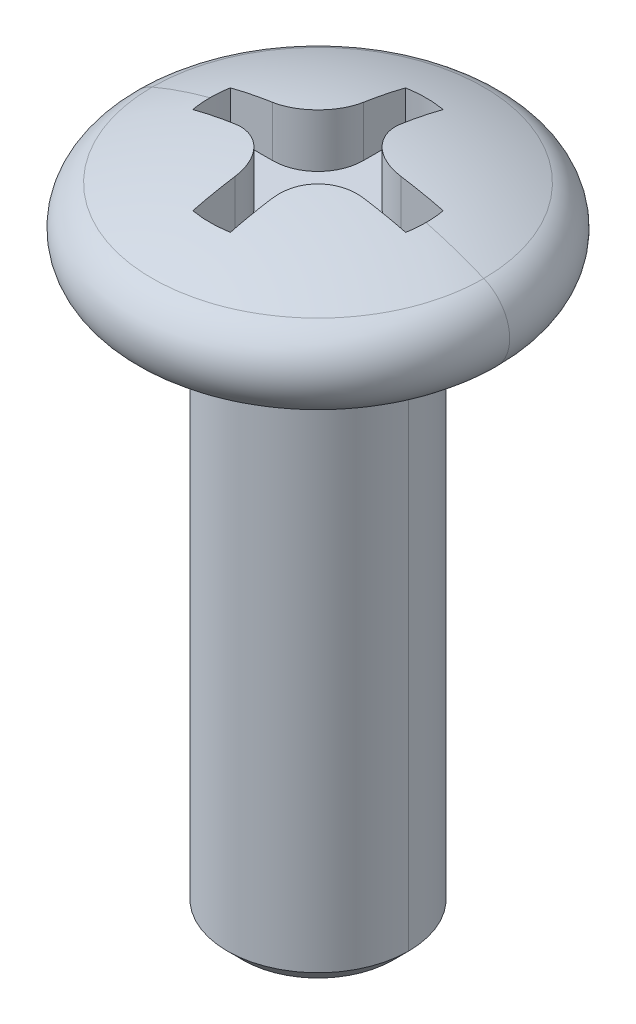
ISO-10303-21;
HEADER;
FILE_DESCRIPTION(('STEP AP214'),'2;1');
FILE_NAME('part.step','',(''),(''),'','','');
FILE_SCHEMA(('AUTOMOTIVE_DESIGN { 1 0 10303 214 1 1 1 1 }'));
ENDSEC;
DATA;
#1=APPLICATION_CONTEXT('core data for automotive mechanical design processes');
#2=APPLICATION_PROTOCOL_DEFINITION('international standard','automotive_design',2000,#1);
#3=PRODUCT_CONTEXT('',#1,'mechanical');
#4=PRODUCT('Part','Part','',(#3));
#5=PRODUCT_RELATED_PRODUCT_CATEGORY('part','',(#4));
#6=PRODUCT_DEFINITION_FORMATION('','',#4);
#7=PRODUCT_DEFINITION_CONTEXT('part definition',#1,'design');
#8=PRODUCT_DEFINITION('design','',#6,#7);
#9=PRODUCT_DEFINITION_SHAPE('','',#8);
#10=(LENGTH_UNIT() NAMED_UNIT(*) SI_UNIT(.MILLI.,.METRE.));
#11=(NAMED_UNIT(*) PLANE_ANGLE_UNIT() SI_UNIT($,.RADIAN.));
#12=(NAMED_UNIT(*) SI_UNIT($,.STERADIAN.) SOLID_ANGLE_UNIT());
#13=UNCERTAINTY_MEASURE_WITH_UNIT(LENGTH_MEASURE(1.E-05),#10,'distance_accuracy_value','');
#14=(GEOMETRIC_REPRESENTATION_CONTEXT(3) GLOBAL_UNCERTAINTY_ASSIGNED_CONTEXT((#13)) GLOBAL_UNIT_ASSIGNED_CONTEXT((#10,
#11,#12)) REPRESENTATION_CONTEXT('',''));
#15=CARTESIAN_POINT('',(0.,0.,0.));
#16=DIRECTION('',(0.,0.,1.));
#17=DIRECTION('',(1.,0.,0.));
#18=AXIS2_PLACEMENT_3D('',#15,#16,#17);
#19=CARTESIAN_POINT('',(-0.9192388155425,0.8,0.9192388155425));
#20=DIRECTION('',(0.,-1.,0.));
#21=DIRECTION('',(1.,0.,0.));
#22=AXIS2_PLACEMENT_3D('',#19,#20,#21);
#23=CYLINDRICAL_SURFACE('',#22,0.65);
#24=DIRECTION('',(0.,1.,0.));
#25=VECTOR('',#24,1.);
#26=CARTESIAN_POINT('',(-0.2692388155425,0.8,0.9192388155425));
#27=LINE('',#26,#25);
#28=CARTESIAN_POINT('',(-0.2692388155425,0.8,0.9192388155425));
#29=VERTEX_POINT('',#28);
#30=CARTESIAN_POINT('',(-0.2692388155425,1.524713772175,0.9192388155425));
#31=VERTEX_POINT('',#30);
#32=EDGE_CURVE('E11',#29,#31,#27,.T.);
#33=ORIENTED_EDGE('',*,*,#32,.F.);
#34=CARTESIAN_POINT('',(-0.9192388155425,0.8,0.9192388155425));
#35=DIRECTION('',(0.,1.,0.));
#36=DIRECTION('',(1.,0.,0.));
#37=AXIS2_PLACEMENT_3D('',#34,#35,#36);
#38=CIRCLE('',#37,0.65);
#39=CARTESIAN_POINT('',(-0.9192388155425,0.8,0.2692388155425));
#40=VERTEX_POINT('',#39);
#41=EDGE_CURVE('E385',#29,#40,#38,.T.);
#42=ORIENTED_EDGE('',*,*,#41,.T.);
#43=DIRECTION('',(0.,-1.,0.));
#44=VECTOR('',#43,1.);
#45=CARTESIAN_POINT('',(-0.9192388155425,1.524713772175,0.2692388155425));
#46=LINE('',#45,#44);
#47=CARTESIAN_POINT('',(-0.9192388155425,1.524713772175,0.2692388155425));
#48=VERTEX_POINT('',#47);
#49=EDGE_CURVE('E293',#48,#40,#46,.T.);
#50=ORIENTED_EDGE('',*,*,#49,.F.);
#51=CARTESIAN_POINT('',(-0.9192388155425,1.524713772175,0.2692388155425));
#52=CARTESIAN_POINT('',(-0.9074310686068,1.52650615110908,0.269238446253447));
#53=CARTESIAN_POINT('',(-0.895615272198012,1.52824602192528,0.269560549683236));
#54=CARTESIAN_POINT('',(-0.872090656978426,1.53160575261905,0.27084490478952));
#55=CARTESIAN_POINT('',(-0.860381692032317,1.53322640316312,0.271802416359884));
#56=CARTESIAN_POINT('',(-0.837104387656604,1.5363477025073,0.274343450276883));
#57=CARTESIAN_POINT('',(-0.825535647138162,1.53784914564995,0.27592232050701));
#58=CARTESIAN_POINT('',(-0.80257104060165,1.54073202301527,0.279689739434019));
#59=CARTESIAN_POINT('',(-0.791174529032696,1.54211425498701,0.281873742397225));
#60=CARTESIAN_POINT('',(-0.768585092818777,1.54475870767343,0.286833721121907));
#61=CARTESIAN_POINT('',(-0.757391289952753,1.54602172909309,0.289605269829644));
#62=CARTESIAN_POINT('',(-0.735236411936503,1.54842775758934,0.295721199796129));
#63=CARTESIAN_POINT('',(-0.7242742382256,1.54957156789024,0.299061285305573));
#64=CARTESIAN_POINT('',(-0.702610136797941,1.55173917183213,0.306293886986267));
#65=CARTESIAN_POINT('',(-0.691906903150353,1.55276377074186,0.310182249932129));
#66=CARTESIAN_POINT('',(-0.670786541964911,1.55469294997501,0.318489853379582));
#67=CARTESIAN_POINT('',(-0.66036791460645,1.55559833711162,0.322905093420829));
#68=CARTESIAN_POINT('',(-0.639840938980817,1.55728909144049,0.33224387256373));
#69=CARTESIAN_POINT('',(-0.629730910926184,1.55807526646086,0.337163573097342));
#70=CARTESIAN_POINT('',(-0.609843599254808,1.55952759560189,0.347487789403707));
#71=CARTESIAN_POINT('',(-0.60006447016581,1.56019455800855,0.352888636532991));
#72=CARTESIAN_POINT('',(-0.580859701553964,1.56140846202144,0.364150875794801));
#73=CARTESIAN_POINT('',(-0.571432065433913,1.56195621178094,0.370008776133694));
#74=CARTESIAN_POINT('',(-0.552949301480528,1.56293168940802,0.382160182683809));
#75=CARTESIAN_POINT('',(-0.543892040690252,1.56336022469205,0.388450379761691));
#76=CARTESIAN_POINT('',(-0.526167324419638,1.56409727950977,0.401440881835909));
#77=CARTESIAN_POINT('',(-0.517497614488045,1.56440660503152,0.408138065091579));
#78=CARTESIAN_POINT('',(-0.500563572370234,1.56490522272647,0.42191660729582));
#79=CARTESIAN_POINT('',(-0.492296879224918,1.56509531895082,0.428995035439314));
#80=CARTESIAN_POINT('',(-0.476182774632976,1.56535555125927,0.443509757008436));
#81=CARTESIAN_POINT('',(-0.468332910393138,1.56542648814329,0.450943313374388));
#82=CARTESIAN_POINT('',(-0.453064566345436,1.56544814276625,0.466141895467096));
#83=CARTESIAN_POINT('',(-0.4456435575074,1.56539965954977,0.473904378359195));
#84=CARTESIAN_POINT('',(-0.432014745253798,1.56519502134574,0.488886267612526));
#85=CARTESIAN_POINT('',(-0.425764755762494,1.56505168982395,0.49606753913544));
#86=CARTESIAN_POINT('',(-0.413545282212392,1.56467217208865,0.51074662327956));
#87=CARTESIAN_POINT('',(-0.407578026317929,1.56443535321255,0.518246275235795));
#88=CARTESIAN_POINT('',(-0.395942263672614,1.56386863409642,0.533552700650459));
#89=CARTESIAN_POINT('',(-0.390276114532105,1.5635381000105,0.541361242664686));
#90=CARTESIAN_POINT('',(-0.379260528967508,1.56278401129438,0.557275074640531));
#91=CARTESIAN_POINT('',(-0.373913576829251,1.56235982402645,0.56538205431645));
#92=CARTESIAN_POINT('',(-0.363554153178315,1.56141841144204,0.581881281223663));
#93=CARTESIAN_POINT('',(-0.358544290296129,1.56090055452427,0.590275130293663));
#94=CARTESIAN_POINT('',(-0.348876516433032,1.55977180587096,0.607335537358158));
#95=CARTESIAN_POINT('',(-0.344221335253281,1.55916028407257,0.616003600586359));
#96=CARTESIAN_POINT('',(-0.33528004615892,1.55784420282904,0.633598782636722));
#97=CARTESIAN_POINT('',(-0.330996785542429,1.55713901515387,0.642527301359418));
#98=CARTESIAN_POINT('',(-0.322816040481119,1.55563560054651,0.660628646432735));
#99=CARTESIAN_POINT('',(-0.318921516560794,1.5548367475443,0.669802758751507));
#100=CARTESIAN_POINT('',(-0.311534462825615,1.55314599994537,0.688379448573204));
#101=CARTESIAN_POINT('',(-0.308045001919916,1.5522534817337,0.697783189652646));
#102=CARTESIAN_POINT('',(-0.301483738003251,1.55037540119559,0.716802205043263));
#103=CARTESIAN_POINT('',(-0.298415106866604,1.54938921799037,0.726418512263573));
#104=CARTESIAN_POINT('',(-0.292710542629367,1.54732380465771,0.745844647122604));
#105=CARTESIAN_POINT('',(-0.290077878381705,1.54624395665065,0.755655368945319));
#106=CARTESIAN_POINT('',(-0.28525959111327,1.54399121059184,0.775451252548606));
#107=CARTESIAN_POINT('',(-0.283077327356886,1.54281769790553,0.785437161988074));
#108=CARTESIAN_POINT('',(-0.279173423101076,1.54037761937338,0.805563289154129));
#109=CARTESIAN_POINT('',(-0.277455225209891,1.53911044236993,0.815704100501387));
#110=CARTESIAN_POINT('',(-0.274492171202288,1.53648303092039,0.836118873825482));
#111=CARTESIAN_POINT('',(-0.273250833208777,1.53512218900115,0.846393268226588));
#112=CARTESIAN_POINT('',(-0.271253392774698,1.53230744679113,0.867053037888451));
#113=CARTESIAN_POINT('',(-0.27050087642024,1.53085294293673,0.877438677494751));
#114=CARTESIAN_POINT('',(-0.269491653146706,1.52785086229013,0.898297834867702));
#115=CARTESIAN_POINT('',(-0.269238589138356,1.52630268593064,0.908771442771305));
#116=CARTESIAN_POINT('',(-0.2692388155425,1.524713772175,0.919238815542503));
#117=B_SPLINE_CURVE_WITH_KNOTS('',3,(#51,#52,#53,#54,#55,#56,#57,#58,#59,#60,#61,#62,#63,#64,
#65,#66,#67,#68,#69,#70,#71,#72,#73,#74,#75,#76,#77,#78,#79,#80,#81,#82,#83,#84,#85,#86,#87,#88,
#89,#90,#91,#92,#93,#94,#95,#96,#97,#98,#99,#100,#101,#102,#103,#104,#105,#106,#107,#108,#109,
#110,#111,#112,#113,#114,#115,#116),.UNSPECIFIED.,.F.,.F.,(4,2,2,2,2,2,2,2,2,2,2,2,2,2,2,2,2,2,
2,2,2,2,2,2,2,2,2,2,2,2,2,2,4),(0.,0.0358246705922917,0.0713850512791919,0.106684107049631,
0.141724869252869,0.176510436788276,0.21104397727965,0.245328728230408,0.279367998155793,
0.31316516768797,0.346723690649654,0.380047095091673,0.413138984289623,0.44600303769455,
0.478643011832356,0.511062741146402,0.543266138777583,0.571820381132513,0.600571267333102,
0.629521450077506,0.658673527642513,0.688030044680905,0.717593493038226,0.747366312586197,
0.777350892070108,0.807549569967726,0.837964635357372,0.868598328792974,0.899452843184075,
0.930530324678863,0.961832873548483,0.993362545070976,1.02512135041333),.UNSPECIFIED.);
#118=EDGE_CURVE('E276',#48,#31,#117,.T.);
#119=ORIENTED_EDGE('',*,*,#118,.T.);
#120=EDGE_LOOP('',(#33,#42,#50,#119));
#121=FACE_BOUND('',#120,.T.);
#122=ADVANCED_FACE('F17',(#121),#23,.T.);
#123=CARTESIAN_POINT('',(-0.2692388155425,0.8,1.526437178598));
#124=DIRECTION('',(-1.,0.,0.));
#125=DIRECTION('',(0.,0.,1.));
#126=AXIS2_PLACEMENT_3D('',#123,#124,#125);
#127=PLANE('',#126);
#128=DIRECTION('',(-7.80448763563202E-08,-0.999999999992203,3.94812511535701E-06));
#129=VECTOR('',#128,1.);
#130=CARTESIAN_POINT('',(-0.2692387686505,1.400833809048,1.526438143998));
#131=LINE('',#130,#129);
#132=CARTESIAN_POINT('',(-0.2692388155425,1.400834055347,1.526437178598));
#133=VERTEX_POINT('',#132);
#134=CARTESIAN_POINT('',(-0.269237102762,0.8,1.526437480703));
#135=VERTEX_POINT('',#134);
#136=EDGE_CURVE('E27',#133,#135,#131,.T.);
#137=ORIENTED_EDGE('',*,*,#136,.T.);
#138=DIRECTION('',(0.,0.,1.));
#139=VECTOR('',#138,1.);
#140=CARTESIAN_POINT('',(-0.2692388155425,0.8,0.9192388155425));
#141=LINE('',#140,#139);
#142=EDGE_CURVE('E371',#29,#135,#141,.T.);
#143=ORIENTED_EDGE('',*,*,#142,.F.);
#144=ORIENTED_EDGE('',*,*,#32,.T.);
#145=CARTESIAN_POINT('',(-0.2692388155425,-4.530985590341,0.));
#146=DIRECTION('',(1.,0.,0.));
#147=DIRECTION('',(0.,0.988674149471102,0.1500780669105));
#148=AXIS2_PLACEMENT_3D('',#145,#146,#147);
#149=CIRCLE('',#148,6.125071001154);
#150=EDGE_CURVE('E372',#31,#133,#149,.T.);
#151=ORIENTED_EDGE('',*,*,#150,.T.);
#152=EDGE_LOOP('',(#137,#143,#144,#151));
#153=FACE_BOUND('',#152,.T.);
#154=ADVANCED_FACE('F359',(#153),#127,.F.);
#155=CARTESIAN_POINT('',(0.,0.8,0.));
#156=DIRECTION('',(0.,-1.,0.));
#157=DIRECTION('',(1.,0.,0.));
#158=AXIS2_PLACEMENT_3D('',#155,#156,#157);
#159=CYLINDRICAL_SURFACE('',#158,1.55);
#160=DIRECTION('',(0.,1.,0.));
#161=VECTOR('',#160,1.);
#162=CARTESIAN_POINT('',(0.2692388155425,0.8,1.526437178598));
#163=LINE('',#162,#161);
#164=CARTESIAN_POINT('',(0.2692388155425,0.8,1.526437178598));
#165=VERTEX_POINT('',#164);
#166=CARTESIAN_POINT('',(0.2692388155424,1.400834055347,1.526437178598));
#167=VERTEX_POINT('',#166);
#168=EDGE_CURVE('E271',#165,#167,#163,.T.);
#169=ORIENTED_EDGE('',*,*,#168,.F.);
#170=CARTESIAN_POINT('',(0.,0.8,0.));
#171=DIRECTION('',(0.,-1.,0.));
#172=DIRECTION('',(0.173702461640309,0.,0.984798179740447));
#173=AXIS2_PLACEMENT_3D('',#170,#171,#172);
#174=CIRCLE('',#173,1.55);
#175=EDGE_CURVE('E378',#165,#135,#174,.T.);
#176=ORIENTED_EDGE('',*,*,#175,.T.);
#177=ORIENTED_EDGE('',*,*,#136,.F.);
#178=CARTESIAN_POINT('',(0.,1.400834055347,0.));
#179=DIRECTION('',(0.,1.,0.));
#180=DIRECTION('',(-0.173702461640291,0.,0.98479817974045));
#181=AXIS2_PLACEMENT_3D('',#178,#179,#180);
#182=CIRCLE('',#181,1.55);
#183=EDGE_CURVE('E404',#133,#167,#182,.T.);
#184=ORIENTED_EDGE('',*,*,#183,.T.);
#185=EDGE_LOOP('',(#169,#176,#177,#184));
#186=FACE_BOUND('',#185,.T.);
#187=ADVANCED_FACE('F356',(#186),#159,.F.);
#188=CARTESIAN_POINT('',(0.2692388155425,0.8,0.9192388155425));
#189=DIRECTION('',(1.,0.,0.));
#190=DIRECTION('',(0.,1.,0.));
#191=AXIS2_PLACEMENT_3D('',#188,#189,#190);
#192=PLANE('',#191);
#193=DIRECTION('',(0.,-1.,0.));
#194=VECTOR('',#193,1.);
#195=CARTESIAN_POINT('',(0.2692388155425,1.524713772175,0.9192388155426));
#196=LINE('',#195,#194);
#197=CARTESIAN_POINT('',(0.2692388155425,1.524713772175,0.9192388155425));
#198=VERTEX_POINT('',#197);
#199=CARTESIAN_POINT('',(0.2692388155425,0.8,0.9192388155425));
#200=VERTEX_POINT('',#199);
#201=EDGE_CURVE('E268',#198,#200,#196,.T.);
#202=ORIENTED_EDGE('',*,*,#201,.T.);
#203=DIRECTION('',(0.,0.,-1.));
#204=VECTOR('',#203,1.);
#205=CARTESIAN_POINT('',(0.2692388155425,0.8,1.526437178598));
#206=LINE('',#205,#204);
#207=EDGE_CURVE('E382',#165,#200,#206,.T.);
#208=ORIENTED_EDGE('',*,*,#207,.F.);
#209=ORIENTED_EDGE('',*,*,#168,.T.);
#210=CARTESIAN_POINT('',(0.2692388155425,-4.530985590341,0.));
#211=DIRECTION('',(-1.,0.,0.));
#212=DIRECTION('',(0.,0.968449124029834,0.249211344376309));
#213=AXIS2_PLACEMENT_3D('',#210,#211,#212);
#214=CIRCLE('',#213,6.125071001154);
#215=EDGE_CURVE('E402',#167,#198,#214,.T.);
#216=ORIENTED_EDGE('',*,*,#215,.T.);
#217=EDGE_LOOP('',(#202,#208,#209,#216));
#218=FACE_BOUND('',#217,.T.);
#219=ADVANCED_FACE('F352',(#218),#192,.F.);
#220=CARTESIAN_POINT('',(0.9192388155425,0.8,0.9192388155425));
#221=DIRECTION('',(0.,-1.,0.));
#222=DIRECTION('',(1.,0.,0.));
#223=AXIS2_PLACEMENT_3D('',#220,#221,#222);
#224=CYLINDRICAL_SURFACE('',#223,0.65);
#225=DIRECTION('',(0.,1.,0.));
#226=VECTOR('',#225,1.);
#227=CARTESIAN_POINT('',(0.9192388155425,0.8,0.2692388155425));
#228=LINE('',#227,#226);
#229=CARTESIAN_POINT('',(0.9192388155425,0.8,0.2692388155425));
#230=VERTEX_POINT('',#229);
#231=CARTESIAN_POINT('',(0.9192388155425,1.524713772175,0.2692388155425));
#232=VERTEX_POINT('',#231);
#233=EDGE_CURVE('E265',#230,#232,#228,.T.);
#234=ORIENTED_EDGE('',*,*,#233,.F.);
#235=CARTESIAN_POINT('',(0.9192388155425,0.8,0.9192388155425));
#236=DIRECTION('',(0.,1.,0.));
#237=DIRECTION('',(0.,0.,-1.));
#238=AXIS2_PLACEMENT_3D('',#235,#236,#237);
#239=CIRCLE('',#238,0.65);
#240=EDGE_CURVE('E394',#230,#200,#239,.T.);
#241=ORIENTED_EDGE('',*,*,#240,.T.);
#242=ORIENTED_EDGE('',*,*,#201,.F.);
#243=CARTESIAN_POINT('',(0.2692388155425,1.524713772175,0.9192388155426));
#244=CARTESIAN_POINT('',(0.2692388155425,1.528173358562,0.8964479860821));
#245=CARTESIAN_POINT('',(0.2716391462575,1.534710181967,0.8509457547024));
#246=CARTESIAN_POINT('',(0.2823174412293,1.543276861226,0.7836954329013));
#247=CARTESIAN_POINT('',(0.2999141859791,1.550540336036,0.7180699570745));
#248=CARTESIAN_POINT('',(0.3241734858009,1.556433791834,0.654798701252));
#249=CARTESIAN_POINT('',(0.3549032683568,1.560918753447,0.5943551458814));
#250=CARTESIAN_POINT('',(0.3915438705881,1.563933367371,0.5377297774847));
#251=CARTESIAN_POINT('',(0.4337882814405,1.565477277769,0.4852465083553));
#252=CARTESIAN_POINT('',(0.4813863367753,1.565539945037,0.4372327998011));
#253=CARTESIAN_POINT('',(0.5343962340297,1.564076941955,0.3939254125477));
#254=CARTESIAN_POINT('',(0.5909074605196,1.561128800732,0.3569587413935));
#255=CARTESIAN_POINT('',(0.6480865921722,1.556959695013,0.3274019004167));
#256=CARTESIAN_POINT('',(0.7034772044515,1.551941345377,0.3052341972903));
#257=CARTESIAN_POINT('',(0.7539825373544,1.546617078766,0.2899462812353));
#258=CARTESIAN_POINT('',(0.7999506907473,1.541202793061,0.2797591323471));
#259=CARTESIAN_POINT('',(0.8420768817187,1.535784685688,0.2734071671928));
#260=CARTESIAN_POINT('',(0.8814305699262,1.530342486284,0.269954903621));
#261=CARTESIAN_POINT('',(0.9068499427183,1.526594369625,0.2692388155425));
#262=CARTESIAN_POINT('',(0.9192388155425,1.524713772175,0.2692388155425));
#263=(BOUNDED_CURVE() B_SPLINE_CURVE(3,(#243,#244,#245,#246,#247,#248,#249,#250,#251,#252,#253,
#254,#255,#256,#257,#258,#259,#260,#261,#262),.UNSPECIFIED.,.F.,
.F.) B_SPLINE_CURVE_WITH_KNOTS((4,1,1,1,1,1,1,1,1,1,1,1,1,1,1,1,1,4),(0.,0.05882352941176,
0.1176470588235,0.1764705882353,0.2352941176471,0.2941176470588,0.3529411764706,0.4117647058824,
0.4705882352941,0.5294117647059,0.5882352941176,0.6470588235294,0.7058823529412,0.7647058823529,
0.8235294117647,0.8823529411765,0.9411764705882,1.),
.UNSPECIFIED.) CURVE() GEOMETRIC_REPRESENTATION_ITEM() RATIONAL_B_SPLINE_CURVE((1.,1.,1.,1.,1.,
1.,1.,1.,1.,1.,1.,1.,1.,1.,1.,1.,1.,1.,1.,1.)) REPRESENTATION_ITEM(''));
#264=EDGE_CURVE('E409',#198,#232,#263,.T.);
#265=ORIENTED_EDGE('',*,*,#264,.T.);
#266=EDGE_LOOP('',(#234,#241,#242,#265));
#267=FACE_BOUND('',#266,.T.);
#268=ADVANCED_FACE('F348',(#267),#224,.T.);
#269=CARTESIAN_POINT('',(1.526437178598,0.8,0.2692388155425));
#270=DIRECTION('',(0.,0.,1.));
#271=DIRECTION('',(1.,0.,0.));
#272=AXIS2_PLACEMENT_3D('',#269,#270,#271);
#273=PLANE('',#272);
#274=DIRECTION('',(2.78619148034305E-06,-0.999999999996119,7.78073388432314E-10));
#275=VECTOR('',#274,1.);
#276=CARTESIAN_POINT('',(1.526437181508,1.400834054619,0.269238815075));
#277=LINE('',#276,#275);
#278=CARTESIAN_POINT('',(1.526437178598,1.400834055347,0.2692388155425));
#279=VERTEX_POINT('',#278);
#280=CARTESIAN_POINT('',(1.52643733039,0.8,0.2692379549589));
#281=VERTEX_POINT('',#280);
#282=EDGE_CURVE('E262',#279,#281,#277,.T.);
#283=ORIENTED_EDGE('',*,*,#282,.T.);
#284=DIRECTION('',(1.,0.,0.));
#285=VECTOR('',#284,1.);
#286=CARTESIAN_POINT('',(0.9192388155425,0.8,0.2692388155425));
#287=LINE('',#286,#285);
#288=EDGE_CURVE('E397',#230,#281,#287,.T.);
#289=ORIENTED_EDGE('',*,*,#288,.F.);
#290=ORIENTED_EDGE('',*,*,#233,.T.);
#291=CARTESIAN_POINT('',(0.,-4.530985590341,0.2692388155425));
#292=DIRECTION('',(0.,0.,-1.));
#293=DIRECTION('',(0.1500780669105,0.988674149471102,0.));
#294=AXIS2_PLACEMENT_3D('',#291,#292,#293);
#295=CIRCLE('',#294,6.125071001154);
#296=EDGE_CURVE('E414',#232,#279,#295,.T.);
#297=ORIENTED_EDGE('',*,*,#296,.T.);
#298=EDGE_LOOP('',(#283,#289,#290,#297));
#299=FACE_BOUND('',#298,.T.);
#300=ADVANCED_FACE('F344',(#299),#273,.F.);
#301=CARTESIAN_POINT('',(0.,0.8,0.));
#302=DIRECTION('',(0.,-1.,0.));
#303=DIRECTION('',(1.,0.,0.));
#304=AXIS2_PLACEMENT_3D('',#301,#302,#303);
#305=CYLINDRICAL_SURFACE('',#304,1.55);
#306=CARTESIAN_POINT('',(0.,1.400834055347,0.));
#307=DIRECTION('',(0.,1.,0.));
#308=DIRECTION('',(0.9999999996202,0.,-2.756082953154E-05));
#309=AXIS2_PLACEMENT_3D('',#306,#307,#308);
#310=CIRCLE('',#309,1.55);
#311=CARTESIAN_POINT('',(1.55,1.400834055347,0.));
#312=VERTEX_POINT('',#311);
#313=CARTESIAN_POINT('',(1.526437178598,1.400834055347,-0.2692388155424));
#314=VERTEX_POINT('',#313);
#315=EDGE_CURVE('E470',#312,#314,#310,.T.);
#316=ORIENTED_EDGE('',*,*,#315,.T.);
#317=DIRECTION('',(0.,1.,0.));
#318=VECTOR('',#317,1.);
#319=CARTESIAN_POINT('',(1.526437178598,0.8,-0.2692388155425));
#320=LINE('',#319,#318);
#321=CARTESIAN_POINT('',(1.526437178598,0.8,-0.2692388155425));
#322=VERTEX_POINT('',#321);
#323=EDGE_CURVE('E259',#322,#314,#320,.T.);
#324=ORIENTED_EDGE('',*,*,#323,.F.);
#325=CARTESIAN_POINT('',(0.,0.8,0.));
#326=DIRECTION('',(0.,-1.,0.));
#327=DIRECTION('',(0.984798179740447,0.,-0.173702461640309));
#328=AXIS2_PLACEMENT_3D('',#325,#326,#327);
#329=CIRCLE('',#328,1.55);
#330=CARTESIAN_POINT('',(1.55,0.8,0.));
#331=VERTEX_POINT('',#330);
#332=EDGE_CURVE('E563',#322,#331,#329,.T.);
#333=ORIENTED_EDGE('',*,*,#332,.T.);
#334=CARTESIAN_POINT('',(0.,0.8,0.));
#335=DIRECTION('',(0.,-1.,0.));
#336=DIRECTION('',(1.,0.,0.));
#337=AXIS2_PLACEMENT_3D('',#334,#335,#336);
#338=CIRCLE('',#337,1.55);
#339=EDGE_CURVE('E422',#331,#281,#338,.T.);
#340=ORIENTED_EDGE('',*,*,#339,.T.);
#341=ORIENTED_EDGE('',*,*,#282,.F.);
#342=CARTESIAN_POINT('',(0.,1.400834055347,0.));
#343=DIRECTION('',(0.,1.,0.));
#344=DIRECTION('',(0.98479817974045,0.,0.173702461640291));
#345=AXIS2_PLACEMENT_3D('',#342,#343,#344);
#346=CIRCLE('',#345,1.55);
#347=EDGE_CURVE('E450',#279,#312,#346,.T.);
#348=ORIENTED_EDGE('',*,*,#347,.T.);
#349=EDGE_LOOP('',(#316,#324,#333,#340,#341,#348));
#350=FACE_BOUND('',#349,.T.);
#351=ADVANCED_FACE('F340',(#350),#305,.F.);
#352=CARTESIAN_POINT('',(0.9192388155425,0.8,-0.2692388155425));
#353=DIRECTION('',(0.,0.,-1.));
#354=DIRECTION('',(0.,-1.,0.));
#355=AXIS2_PLACEMENT_3D('',#352,#353,#354);
#356=PLANE('',#355);
#357=DIRECTION('',(0.,-1.,0.));
#358=VECTOR('',#357,1.);
#359=CARTESIAN_POINT('',(0.9192388155425,1.524713772175,-0.2692388155425));
#360=LINE('',#359,#358);
#361=CARTESIAN_POINT('',(0.9192388155425,1.524713772175,-0.2692388155425));
#362=VERTEX_POINT('',#361);
#363=CARTESIAN_POINT('',(0.9192388155425,0.8,-0.2692388155425));
#364=VERTEX_POINT('',#363);
#365=EDGE_CURVE('E258',#362,#364,#360,.T.);
#366=ORIENTED_EDGE('',*,*,#365,.T.);
#367=DIRECTION('',(-1.,0.,0.));
#368=VECTOR('',#367,1.);
#369=CARTESIAN_POINT('',(1.526437178598,0.8,-0.2692388155425));
#370=LINE('',#369,#368);
#371=EDGE_CURVE('E244',#322,#364,#370,.T.);
#372=ORIENTED_EDGE('',*,*,#371,.F.);
#373=ORIENTED_EDGE('',*,*,#323,.T.);
#374=CARTESIAN_POINT('',(0.,-4.530985590341,-0.2692388155425));
#375=DIRECTION('',(0.,0.,1.));
#376=DIRECTION('',(0.249211344376309,0.968449124029834,0.));
#377=AXIS2_PLACEMENT_3D('',#374,#375,#376);
#378=CIRCLE('',#377,6.125071001154);
#379=EDGE_CURVE('E478',#314,#362,#378,.T.);
#380=ORIENTED_EDGE('',*,*,#379,.T.);
#381=EDGE_LOOP('',(#366,#372,#373,#380));
#382=FACE_BOUND('',#381,.T.);
#383=ADVANCED_FACE('F336',(#382),#356,.F.);
#384=CARTESIAN_POINT('',(0.9192388155425,0.8,-0.9192388155425));
#385=DIRECTION('',(0.,-1.,0.));
#386=DIRECTION('',(1.,0.,0.));
#387=AXIS2_PLACEMENT_3D('',#384,#385,#386);
#388=CYLINDRICAL_SURFACE('',#387,0.65);
#389=DIRECTION('',(0.,1.,0.));
#390=VECTOR('',#389,1.);
#391=CARTESIAN_POINT('',(0.2692388155425,0.8,-0.9192388155425));
#392=LINE('',#391,#390);
#393=CARTESIAN_POINT('',(0.2692388155425,0.8,-0.9192388155425));
#394=VERTEX_POINT('',#393);
#395=CARTESIAN_POINT('',(0.2692388155425,1.524713772175,-0.9192388155425));
#396=VERTEX_POINT('',#395);
#397=EDGE_CURVE('E221',#394,#396,#392,.T.);
#398=ORIENTED_EDGE('',*,*,#397,.F.);
#399=CARTESIAN_POINT('',(0.9192388155425,0.8,-0.9192388155425));
#400=DIRECTION('',(0.,1.,0.));
#401=DIRECTION('',(-1.,0.,0.));
#402=AXIS2_PLACEMENT_3D('',#399,#400,#401);
#403=CIRCLE('',#402,0.65);
#404=EDGE_CURVE('E237',#394,#364,#403,.T.);
#405=ORIENTED_EDGE('',*,*,#404,.T.);
#406=ORIENTED_EDGE('',*,*,#365,.F.);
#407=CARTESIAN_POINT('',(0.9192388155425,1.524713772175,-0.2692388155425));
#408=CARTESIAN_POINT('',(0.8963342539164,1.528190622798,-0.2692388155425));
#409=CARTESIAN_POINT('',(0.8529981369015,1.53439343812,-0.2716735468639));
#410=CARTESIAN_POINT('',(0.7967943874806,1.541624730706,-0.2801301719027));
#411=CARTESIAN_POINT('',(0.747130397364,1.547371171132,-0.2918118553663));
#412=CARTESIAN_POINT('',(0.7026885901052,1.551971235258,-0.3058231121433));
#413=CARTESIAN_POINT('',(0.6619605090059,1.555707798003,-0.3218162946301));
#414=CARTESIAN_POINT('',(0.6241002747016,1.558736249297,-0.3396180961245));
#415=CARTESIAN_POINT('',(0.5882225934406,1.561173507407,-0.3593458447157));
#416=CARTESIAN_POINT('',(0.5539166528918,1.563066721172,-0.381102394312));
#417=CARTESIAN_POINT('',(0.520898711111,1.564433541012,-0.4050577874507));
#418=CARTESIAN_POINT('',(0.4892879315126,1.565262121149,-0.4311737625069));
#419=CARTESIAN_POINT('',(0.4591802014663,1.565539581554,-0.4594413207733));
#420=CARTESIAN_POINT('',(0.4310074200441,1.565258563624,-0.4894778681083));
#421=CARTESIAN_POINT('',(0.4048520611129,1.564424638562,-0.5211634700093));
#422=CARTESIAN_POINT('',(0.3809501890858,1.563055742823,-0.5541416416831));
#423=CARTESIAN_POINT('',(0.3591822749778,1.561156444278,-0.5884992487752));
#424=CARTESIAN_POINT('',(0.3394976263773,1.558718598789,-0.6243376792794));
#425=CARTESIAN_POINT('',(0.321711667369,1.555686083179,-0.6622089129575));
#426=CARTESIAN_POINT('',(0.3057976583841,1.551962675516,-0.7027706708721));
#427=CARTESIAN_POINT('',(0.2918031428592,1.547367298018,-0.747164713096));
#428=CARTESIAN_POINT('',(0.2801299615164,1.541624418432,-0.7967966599856));
#429=CARTESIAN_POINT('',(0.271671490361,1.534391068919,-0.8530158289235));
#430=CARTESIAN_POINT('',(0.2692388155425,1.528189632827,-0.8963407755808));
#431=CARTESIAN_POINT('',(0.2692388155425,1.524713772175,-0.9192388155425));
#432=(BOUNDED_CURVE() B_SPLINE_CURVE(3,(#407,#408,#409,#410,#411,#412,#413,#414,#415,#416,#417,
#418,#419,#420,#421,#422,#423,#424,#425,#426,#427,#428,#429,#430,#431),.UNSPECIFIED.,.F.,
.F.) B_SPLINE_CURVE_WITH_KNOTS((4,1,1,1,1,1,1,1,1,1,1,1,1,1,1,1,1,1,1,1,1,1,4),(0.,
0.04545454545455,0.09090909090909,0.1363636363636,0.1818181818182,0.2272727272727,
0.2727272727273,0.3181818181818,0.3636363636364,0.4090909090909,0.4545454545455,0.5,
0.5454545454545,0.5909090909091,0.6363636363636,0.6818181818182,0.7272727272727,0.7727272727273,
0.8181818181818,0.8636363636364,0.9090909090909,0.9545454545455,1.),
.UNSPECIFIED.) CURVE() GEOMETRIC_REPRESENTATION_ITEM() RATIONAL_B_SPLINE_CURVE((1.,1.,1.,1.,1.,
1.,1.,1.,1.,1.,1.,1.,1.,1.,1.,1.,1.,1.,1.,1.,1.,1.,1.,1.,1.)) REPRESENTATION_ITEM(''));
#433=EDGE_CURVE('E511',#362,#396,#432,.T.);
#434=ORIENTED_EDGE('',*,*,#433,.T.);
#435=EDGE_LOOP('',(#398,#405,#406,#434));
#436=FACE_BOUND('',#435,.T.);
#437=ADVANCED_FACE('F333',(#436),#388,.T.);
#438=CARTESIAN_POINT('',(0.2692388155425,0.8,-1.526437178598));
#439=DIRECTION('',(1.,0.,0.));
#440=DIRECTION('',(0.,1.,0.));
#441=AXIS2_PLACEMENT_3D('',#438,#439,#440);
#442=PLANE('',#441);
#443=DIRECTION('',(0.,-0.999999999984572,-5.55488951818784E-06));
#444=VECTOR('',#443,1.);
#445=CARTESIAN_POINT('',(0.2692388155425,1.400834055347,-1.526437178598));
#446=LINE('',#445,#444);
#447=CARTESIAN_POINT('',(0.2692388155425,1.400834055347,-1.526437178598));
#448=VERTEX_POINT('',#447);
#449=CARTESIAN_POINT('',(0.269237102762,0.8,-1.526437480703));
#450=VERTEX_POINT('',#449);
#451=EDGE_CURVE('E209',#448,#450,#446,.T.);
#452=ORIENTED_EDGE('',*,*,#451,.T.);
#453=DIRECTION('',(0.,0.,-1.));
#454=VECTOR('',#453,1.);
#455=CARTESIAN_POINT('',(0.2692388155425,0.8,-0.9192388155425));
#456=LINE('',#455,#454);
#457=EDGE_CURVE('E213',#394,#450,#456,.T.);
#458=ORIENTED_EDGE('',*,*,#457,.F.);
#459=ORIENTED_EDGE('',*,*,#397,.T.);
#460=CARTESIAN_POINT('',(0.2692388155425,-4.530985590341,0.));
#461=DIRECTION('',(-1.,0.,0.));
#462=DIRECTION('',(0.,0.988674149471102,-0.1500780669105));
#463=AXIS2_PLACEMENT_3D('',#460,#461,#462);
#464=CIRCLE('',#463,6.125071001154);
#465=EDGE_CURVE('E216',#396,#448,#464,.T.);
#466=ORIENTED_EDGE('',*,*,#465,.T.);
#467=EDGE_LOOP('',(#452,#458,#459,#466));
#468=FACE_BOUND('',#467,.T.);
#469=ADVANCED_FACE('F211',(#468),#442,.F.);
#470=CARTESIAN_POINT('',(0.,0.8,0.));
#471=DIRECTION('',(0.,-1.,0.));
#472=DIRECTION('',(1.,0.,0.));
#473=AXIS2_PLACEMENT_3D('',#470,#471,#472);
#474=CYLINDRICAL_SURFACE('',#473,1.55);
#475=DIRECTION('',(0.,1.,0.));
#476=VECTOR('',#475,1.);
#477=CARTESIAN_POINT('',(-0.2692388155425,0.8,-1.526437178598));
#478=LINE('',#477,#476);
#479=CARTESIAN_POINT('',(-0.2692388155425,0.8,-1.526437178598));
#480=VERTEX_POINT('',#479);
#481=CARTESIAN_POINT('',(-0.2692388155424,1.400834055347,-1.526437178598));
#482=VERTEX_POINT('',#481);
#483=EDGE_CURVE('E222',#480,#482,#478,.T.);
#484=ORIENTED_EDGE('',*,*,#483,.F.);
#485=CARTESIAN_POINT('',(0.,0.8,0.));
#486=DIRECTION('',(0.,-1.,0.));
#487=DIRECTION('',(-0.173702461640309,0.,-0.984798179740447));
#488=AXIS2_PLACEMENT_3D('',#485,#486,#487);
#489=CIRCLE('',#488,1.55);
#490=EDGE_CURVE('E225',#480,#450,#489,.T.);
#491=ORIENTED_EDGE('',*,*,#490,.T.);
#492=ORIENTED_EDGE('',*,*,#451,.F.);
#493=CARTESIAN_POINT('',(0.,1.400834055347,0.));
#494=DIRECTION('',(0.,1.,0.));
#495=DIRECTION('',(0.173702461640291,0.,-0.98479817974045));
#496=AXIS2_PLACEMENT_3D('',#493,#494,#495);
#497=CIRCLE('',#496,1.55);
#498=EDGE_CURVE('E507',#448,#482,#497,.T.);
#499=ORIENTED_EDGE('',*,*,#498,.T.);
#500=EDGE_LOOP('',(#484,#491,#492,#499));
#501=FACE_BOUND('',#500,.T.);
#502=ADVANCED_FACE('F226',(#501),#474,.F.);
#503=CARTESIAN_POINT('',(-0.2692388155425,0.8,-0.9192388155425));
#504=DIRECTION('',(-1.,0.,0.));
#505=DIRECTION('',(0.,0.,1.));
#506=AXIS2_PLACEMENT_3D('',#503,#504,#505);
#507=PLANE('',#506);
#508=DIRECTION('',(0.,-1.,0.));
#509=VECTOR('',#508,1.);
#510=CARTESIAN_POINT('',(-0.2692388155425,1.524713772175,-0.9192388155425));
#511=LINE('',#510,#509);
#512=CARTESIAN_POINT('',(-0.2692388155425,1.524713772175,-0.9192388155425));
#513=VERTEX_POINT('',#512);
#514=CARTESIAN_POINT('',(-0.2692388155425,0.8,-0.9192388155425));
#515=VERTEX_POINT('',#514);
#516=EDGE_CURVE('E53',#513,#515,#511,.T.);
#517=ORIENTED_EDGE('',*,*,#516,.T.);
#518=DIRECTION('',(0.,0.,1.));
#519=VECTOR('',#518,1.);
#520=CARTESIAN_POINT('',(-0.2692388155425,0.8,-1.526437178598));
#521=LINE('',#520,#519);
#522=EDGE_CURVE('E231',#480,#515,#521,.T.);
#523=ORIENTED_EDGE('',*,*,#522,.F.);
#524=ORIENTED_EDGE('',*,*,#483,.T.);
#525=CARTESIAN_POINT('',(-0.2692388155425,-4.530985590341,0.));
#526=DIRECTION('',(1.,0.,0.));
#527=DIRECTION('',(0.,0.968449124029834,-0.249211344376309));
#528=AXIS2_PLACEMENT_3D('',#525,#526,#527);
#529=CIRCLE('',#528,6.125071001154);
#530=EDGE_CURVE('E505',#482,#513,#529,.T.);
#531=ORIENTED_EDGE('',*,*,#530,.T.);
#532=EDGE_LOOP('',(#517,#523,#524,#531));
#533=FACE_BOUND('',#532,.T.);
#534=ADVANCED_FACE('F320',(#533),#507,.F.);
#535=CARTESIAN_POINT('',(-0.9192388155425,0.8,-0.9192388155425));
#536=DIRECTION('',(0.,-1.,0.));
#537=DIRECTION('',(1.,0.,0.));
#538=AXIS2_PLACEMENT_3D('',#535,#536,#537);
#539=CYLINDRICAL_SURFACE('',#538,0.65);
#540=DIRECTION('',(0.,1.,0.));
#541=VECTOR('',#540,1.);
#542=CARTESIAN_POINT('',(-0.9192388155425,0.8,-0.2692388155425));
#543=LINE('',#542,#541);
#544=CARTESIAN_POINT('',(-0.9192388155425,0.8,-0.2692388155425));
#545=VERTEX_POINT('',#544);
#546=CARTESIAN_POINT('',(-0.9192388155425,1.524713772175,-0.2692388155425));
#547=VERTEX_POINT('',#546);
#548=EDGE_CURVE('E40',#545,#547,#543,.T.);
#549=ORIENTED_EDGE('',*,*,#548,.F.);
#550=CARTESIAN_POINT('',(-0.9192388155425,0.8,-0.9192388155425));
#551=DIRECTION('',(0.,1.,0.));
#552=DIRECTION('',(0.,0.,1.));
#553=AXIS2_PLACEMENT_3D('',#550,#551,#552);
#554=CIRCLE('',#553,0.65);
#555=EDGE_CURVE('E249',#545,#515,#554,.T.);
#556=ORIENTED_EDGE('',*,*,#555,.T.);
#557=ORIENTED_EDGE('',*,*,#516,.F.);
#558=CARTESIAN_POINT('',(-0.2692388155425,1.524713772175,-0.9192388155425));
#559=CARTESIAN_POINT('',(-0.2692388155425,1.528167954166,-0.8964835887973));
#560=CARTESIAN_POINT('',(-0.2716411113283,1.534338829499,-0.853390817738));
#561=CARTESIAN_POINT('',(-0.2800308761267,1.541559151658,-0.7973269006716));
#562=CARTESIAN_POINT('',(-0.2916482324068,1.547304286499,-0.7477362834421));
#563=CARTESIAN_POINT('',(-0.3055880155046,1.551905224846,-0.703360505582));
#564=CARTESIAN_POINT('',(-0.3215168316061,1.555647582167,-0.6626586962956));
#565=CARTESIAN_POINT('',(-0.339274532516,1.558686564805,-0.6247729975292));
#566=CARTESIAN_POINT('',(-0.3590085227161,1.561138672597,-0.5887907893376));
#567=CARTESIAN_POINT('',(-0.3807632952204,1.563043043019,-0.5544127315825));
#568=CARTESIAN_POINT('',(-0.4047770528841,1.564421813642,-0.5212572129577));
#569=CARTESIAN_POINT('',(-0.4309046832131,1.56525657227,-0.4895938109159));
#570=CARTESIAN_POINT('',(-0.4591737906658,1.565540258643,-0.4594432413235));
#571=CARTESIAN_POINT('',(-0.4893337118208,1.565261397442,-0.4311327816658));
#572=CARTESIAN_POINT('',(-0.5209839426024,1.564431057834,-0.4049890236098));
#573=CARTESIAN_POINT('',(-0.5541138459269,1.563057533074,-0.3809661170808));
#574=CARTESIAN_POINT('',(-0.5884719320021,1.561158294468,-0.3591973337454));
#575=CARTESIAN_POINT('',(-0.6244132550635,1.558713207208,-0.3394577704691));
#576=CARTESIAN_POINT('',(-0.6622991923697,1.555678688352,-0.3216703661042));
#577=CARTESIAN_POINT('',(-0.7030372323694,1.551937054431,-0.3057006617547));
#578=CARTESIAN_POINT('',(-0.7474313574827,1.547337768102,-0.2917317592727));
#579=CARTESIAN_POINT('',(-0.7969843512948,1.541600901532,-0.2800975953175));
#580=CARTESIAN_POINT('',(-0.8530633832217,1.534384062674,-0.2716701232534));
#581=CARTESIAN_POINT('',(-0.8963521560242,1.528187905306,-0.2692388155425));
#582=CARTESIAN_POINT('',(-0.9192388155425,1.524713772175,-0.2692388155425));
#583=(BOUNDED_CURVE() B_SPLINE_CURVE(3,(#558,#559,#560,#561,#562,#563,#564,#565,#566,#567,#568,
#569,#570,#571,#572,#573,#574,#575,#576,#577,#578,#579,#580,#581,#582),.UNSPECIFIED.,.F.,
.F.) B_SPLINE_CURVE_WITH_KNOTS((4,1,1,1,1,1,1,1,1,1,1,1,1,1,1,1,1,1,1,1,1,1,4),(0.,
0.04545454545455,0.09090909090909,0.1363636363636,0.1818181818182,0.2272727272727,
0.2727272727273,0.3181818181818,0.3636363636364,0.4090909090909,0.4545454545455,0.5,
0.5454545454545,0.5909090909091,0.6363636363636,0.6818181818182,0.7272727272727,0.7727272727273,
0.8181818181818,0.8636363636364,0.9090909090909,0.9545454545455,1.),
.UNSPECIFIED.) CURVE() GEOMETRIC_REPRESENTATION_ITEM() RATIONAL_B_SPLINE_CURVE((1.,1.,1.,1.,1.,
1.,1.,1.,1.,1.,1.,1.,1.,1.,1.,1.,1.,1.,1.,1.,1.,1.,1.,1.,1.)) REPRESENTATION_ITEM(''));
#584=EDGE_CURVE('E503',#513,#547,#583,.T.);
#585=ORIENTED_EDGE('',*,*,#584,.T.);
#586=EDGE_LOOP('',(#549,#556,#557,#585));
#587=FACE_BOUND('',#586,.T.);
#588=ADVANCED_FACE('F323',(#587),#539,.T.);
#589=CARTESIAN_POINT('',(-1.526437178598,0.8,-0.2692388155425));
#590=DIRECTION('',(0.,0.,-1.));
#591=DIRECTION('',(0.,-1.,0.));
#592=AXIS2_PLACEMENT_3D('',#589,#590,#591);
#593=PLANE('',#592);
#594=DIRECTION('',(-2.79103586676602E-06,-0.999999999996105,0.));
#595=VECTOR('',#594,1.);
#596=CARTESIAN_POINT('',(-1.526437178598,1.400834055347,-0.2692388155425));
#597=LINE('',#596,#595);
#598=CARTESIAN_POINT('',(-1.526437178598,1.400834055347,-0.2692388155424));
#599=VERTEX_POINT('',#598);
#600=CARTESIAN_POINT('',(-1.526438855547,0.8,-0.2692388155425));
#601=VERTEX_POINT('',#600);
#602=EDGE_CURVE('E451',#599,#601,#597,.T.);
#603=ORIENTED_EDGE('',*,*,#602,.T.);
#604=DIRECTION('',(-1.,0.,0.));
#605=VECTOR('',#604,1.);
#606=CARTESIAN_POINT('',(-0.9192388155425,0.8,-0.2692388155425));
#607=LINE('',#606,#605);
#608=EDGE_CURVE('E251',#545,#601,#607,.T.);
#609=ORIENTED_EDGE('',*,*,#608,.F.);
#610=ORIENTED_EDGE('',*,*,#548,.T.);
#611=CARTESIAN_POINT('',(0.,-4.530985590341,-0.2692388155425));
#612=DIRECTION('',(0.,0.,1.));
#613=DIRECTION('',(-0.1500780669105,0.988674149471102,0.));
#614=AXIS2_PLACEMENT_3D('',#611,#612,#613);
#615=CIRCLE('',#614,6.125071001154);
#616=EDGE_CURVE('E500',#547,#599,#615,.T.);
#617=ORIENTED_EDGE('',*,*,#616,.T.);
#618=EDGE_LOOP('',(#603,#609,#610,#617));
#619=FACE_BOUND('',#618,.T.);
#620=ADVANCED_FACE('F319',(#619),#593,.F.);
#621=CARTESIAN_POINT('',(0.,0.8,0.));
#622=DIRECTION('',(0.,-1.,0.));
#623=DIRECTION('',(0.,0.,-1.));
#624=AXIS2_PLACEMENT_3D('',#621,#622,#623);
#625=PLANE('',#624);
#626=ORIENTED_EDGE('',*,*,#41,.F.);
#627=ORIENTED_EDGE('',*,*,#142,.T.);
#628=ORIENTED_EDGE('',*,*,#175,.F.);
#629=ORIENTED_EDGE('',*,*,#207,.T.);
#630=ORIENTED_EDGE('',*,*,#240,.F.);
#631=ORIENTED_EDGE('',*,*,#288,.T.);
#632=ORIENTED_EDGE('',*,*,#339,.F.);
#633=ORIENTED_EDGE('',*,*,#332,.F.);
#634=ORIENTED_EDGE('',*,*,#371,.T.);
#635=ORIENTED_EDGE('',*,*,#404,.F.);
#636=ORIENTED_EDGE('',*,*,#457,.T.);
#637=ORIENTED_EDGE('',*,*,#490,.F.);
#638=ORIENTED_EDGE('',*,*,#522,.T.);
#639=ORIENTED_EDGE('',*,*,#555,.F.);
#640=ORIENTED_EDGE('',*,*,#608,.T.);
#641=CARTESIAN_POINT('',(0.,0.8,0.));
#642=DIRECTION('',(0.,-1.,0.));
#643=DIRECTION('',(-1.,0.,0.));
#644=AXIS2_PLACEMENT_3D('',#641,#642,#643);
#645=CIRCLE('',#644,1.55);
#646=CARTESIAN_POINT('',(-1.55,0.8,0.));
#647=VERTEX_POINT('',#646);
#648=EDGE_CURVE('E487',#647,#601,#645,.T.);
#649=ORIENTED_EDGE('',*,*,#648,.F.);
#650=CARTESIAN_POINT('',(0.,0.8,0.));
#651=DIRECTION('',(0.,-1.,0.));
#652=DIRECTION('',(-0.984798179740447,0.,0.173702461640309));
#653=AXIS2_PLACEMENT_3D('',#650,#651,#652);
#654=CIRCLE('',#653,1.55);
#655=CARTESIAN_POINT('',(-1.526437178598,0.8,0.2692388155425));
#656=VERTEX_POINT('',#655);
#657=EDGE_CURVE('E483',#656,#647,#654,.T.);
#658=ORIENTED_EDGE('',*,*,#657,.F.);
#659=DIRECTION('',(1.,0.,0.));
#660=VECTOR('',#659,1.);
#661=CARTESIAN_POINT('',(-1.526437178598,0.8,0.2692388155425));
#662=LINE('',#661,#660);
#663=EDGE_CURVE('E390',#656,#40,#662,.T.);
#664=ORIENTED_EDGE('',*,*,#663,.T.);
#665=EDGE_LOOP('',(#626,#627,#628,#629,#630,#631,#632,#633,#634,#635,#636,#637,#638,#639,#640,
#649,#658,#664));
#666=FACE_BOUND('',#665,.T.);
#667=ADVANCED_FACE('F234',(#666),#625,.F.);
#668=CARTESIAN_POINT('',(-0.9192388155425,0.8,0.2692388155425));
#669=DIRECTION('',(0.,0.,1.));
#670=DIRECTION('',(1.,0.,0.));
#671=AXIS2_PLACEMENT_3D('',#668,#669,#670);
#672=PLANE('',#671);
#673=ORIENTED_EDGE('',*,*,#49,.T.);
#674=ORIENTED_EDGE('',*,*,#663,.F.);
#675=DIRECTION('',(0.,1.,0.));
#676=VECTOR('',#675,1.);
#677=CARTESIAN_POINT('',(-1.526437178598,0.8,0.2692388155425));
#678=LINE('',#677,#676);
#679=CARTESIAN_POINT('',(-1.526437178598,1.400834055347,0.2692388155424));
#680=VERTEX_POINT('',#679);
#681=EDGE_CURVE('E458',#656,#680,#678,.T.);
#682=ORIENTED_EDGE('',*,*,#681,.T.);
#683=CARTESIAN_POINT('',(0.,-4.530985590341,0.2692388155425));
#684=DIRECTION('',(0.,0.,-1.));
#685=DIRECTION('',(-0.249211344376309,0.968449124029834,0.));
#686=AXIS2_PLACEMENT_3D('',#683,#684,#685);
#687=CIRCLE('',#686,6.125071001154);
#688=EDGE_CURVE('E428',#680,#48,#687,.T.);
#689=ORIENTED_EDGE('',*,*,#688,.T.);
#690=EDGE_LOOP('',(#673,#674,#682,#689));
#691=FACE_BOUND('',#690,.T.);
#692=ADVANCED_FACE('F306',(#691),#672,.F.);
#693=CARTESIAN_POINT('',(0.,-4.530985590341,0.));
#694=DIRECTION('',(0.252814164567912,0.967514856833645,0.));
#695=DIRECTION('',(0.967514856833645,-0.252814164567912,0.));
#696=AXIS2_PLACEMENT_3D('',#693,#694,#695);
#697=SPHERICAL_SURFACE('',#696,6.130985590341);
#698=CARTESIAN_POINT('',(0.,1.400834055347,0.));
#699=DIRECTION('',(0.,1.,0.));
#700=DIRECTION('',(-0.9999999996202,0.,2.756082953167E-05));
#701=AXIS2_PLACEMENT_3D('',#698,#699,#700);
#702=CIRCLE('',#701,1.55);
#703=CARTESIAN_POINT('',(-1.549999999411,1.400834055347,4.27192857741E-05));
#704=VERTEX_POINT('',#703);
#705=EDGE_CURVE('E446',#704,#680,#702,.T.);
#706=ORIENTED_EDGE('',*,*,#705,.F.);
#707=CARTESIAN_POINT('',(0.,-4.530985590341,0.));
#708=DIRECTION('',(0.,0.,1.));
#709=DIRECTION('',(-0.252814164567912,0.967514856833645,0.));
#710=AXIS2_PLACEMENT_3D('',#707,#708,#709);
#711=CIRCLE('',#710,6.130985590341);
#712=CARTESIAN_POINT('',(-2.378097173525,1.12,0.));
#713=VERTEX_POINT('',#712);
#714=EDGE_CURVE('E459',#704,#713,#711,.T.);
#715=ORIENTED_EDGE('',*,*,#714,.T.);
#716=CARTESIAN_POINT('',(0.,1.12,0.));
#717=DIRECTION('',(0.,-1.,0.));
#718=DIRECTION('',(1.,0.,0.));
#719=AXIS2_PLACEMENT_3D('',#716,#717,#718);
#720=CIRCLE('',#719,2.378097173525);
#721=CARTESIAN_POINT('',(2.378097173525,1.12,0.));
#722=VERTEX_POINT('',#721);
#723=EDGE_CURVE('E548',#722,#713,#720,.T.);
#724=ORIENTED_EDGE('',*,*,#723,.F.);
#725=CARTESIAN_POINT('',(0.,-4.530985590341,0.));
#726=DIRECTION('',(0.,0.,-1.));
#727=DIRECTION('',(0.252814164567912,0.967514856833645,0.));
#728=AXIS2_PLACEMENT_3D('',#725,#726,#727);
#729=CIRCLE('',#728,6.130985590341);
#730=EDGE_CURVE('E463',#312,#722,#729,.T.);
#731=ORIENTED_EDGE('',*,*,#730,.F.);
#732=ORIENTED_EDGE('',*,*,#347,.F.);
#733=ORIENTED_EDGE('',*,*,#296,.F.);
#734=ORIENTED_EDGE('',*,*,#264,.F.);
#735=ORIENTED_EDGE('',*,*,#215,.F.);
#736=ORIENTED_EDGE('',*,*,#183,.F.);
#737=ORIENTED_EDGE('',*,*,#150,.F.);
#738=ORIENTED_EDGE('',*,*,#118,.F.);
#739=ORIENTED_EDGE('',*,*,#688,.F.);
#740=EDGE_LOOP('',(#706,#715,#724,#731,#732,#733,#734,#735,#736,#737,#738,#739));
#741=FACE_BOUND('',#740,.T.);
#742=ADVANCED_FACE('F295',(#741),#697,.T.);
#743=CARTESIAN_POINT('',(0.,0.8,0.));
#744=DIRECTION('',(0.,-1.,0.));
#745=DIRECTION('',(1.,0.,0.));
#746=AXIS2_PLACEMENT_3D('',#743,#744,#745);
#747=CYLINDRICAL_SURFACE('',#746,1.55);
#748=ORIENTED_EDGE('',*,*,#681,.F.);
#749=ORIENTED_EDGE('',*,*,#657,.T.);
#750=ORIENTED_EDGE('',*,*,#648,.T.);
#751=ORIENTED_EDGE('',*,*,#602,.F.);
#752=CARTESIAN_POINT('',(0.,1.400834055347,0.));
#753=DIRECTION('',(0.,1.,0.));
#754=DIRECTION('',(-0.98479817974045,0.,-0.173702461640291));
#755=AXIS2_PLACEMENT_3D('',#752,#753,#754);
#756=CIRCLE('',#755,1.55);
#757=EDGE_CURVE('E454',#599,#704,#756,.T.);
#758=ORIENTED_EDGE('',*,*,#757,.T.);
#759=ORIENTED_EDGE('',*,*,#705,.T.);
#760=EDGE_LOOP('',(#748,#749,#750,#751,#758,#759));
#761=FACE_BOUND('',#760,.T.);
#762=ADVANCED_FACE('F305',(#761),#747,.F.);
#763=CARTESIAN_POINT('',(0.,-4.530985590341,0.));
#764=DIRECTION('',(0.,-1.,0.));
#765=DIRECTION('',(-1.,0.,0.));
#766=AXIS2_PLACEMENT_3D('',#763,#764,#765);
#767=SPHERICAL_SURFACE('',#766,6.130985590341);
#768=ORIENTED_EDGE('',*,*,#616,.F.);
#769=ORIENTED_EDGE('',*,*,#584,.F.);
#770=ORIENTED_EDGE('',*,*,#530,.F.);
#771=ORIENTED_EDGE('',*,*,#498,.F.);
#772=ORIENTED_EDGE('',*,*,#465,.F.);
#773=ORIENTED_EDGE('',*,*,#433,.F.);
#774=ORIENTED_EDGE('',*,*,#379,.F.);
#775=ORIENTED_EDGE('',*,*,#315,.F.);
#776=ORIENTED_EDGE('',*,*,#730,.T.);
#777=CARTESIAN_POINT('',(0.,1.12,0.));
#778=DIRECTION('',(0.,-1.,0.));
#779=DIRECTION('',(-1.,0.,0.));
#780=AXIS2_PLACEMENT_3D('',#777,#778,#779);
#781=CIRCLE('',#780,2.378097173525);
#782=EDGE_CURVE('E504',#713,#722,#781,.T.);
#783=ORIENTED_EDGE('',*,*,#782,.F.);
#784=ORIENTED_EDGE('',*,*,#714,.F.);
#785=ORIENTED_EDGE('',*,*,#757,.F.);
#786=EDGE_LOOP('',(#768,#769,#770,#771,#772,#773,#774,#775,#776,#783,#784,#785));
#787=FACE_BOUND('',#786,.T.);
#788=ADVANCED_FACE('F309',(#787),#767,.T.);
#789=CARTESIAN_POINT('',(0.,0.56,0.));
#790=DIRECTION('',(0.,-1.,0.));
#791=DIRECTION('',(-1.,0.,0.));
#792=AXIS2_PLACEMENT_3D('',#789,#790,#791);
#793=TOROIDAL_SURFACE('',#792,2.142433076372,0.6075669236282);
#794=CARTESIAN_POINT('',(0.,0.,0.));
#795=DIRECTION('',(0.,1.,0.));
#796=DIRECTION('',(1.,0.,0.));
#797=AXIS2_PLACEMENT_3D('',#794,#795,#796);
#798=CIRCLE('',#797,2.378097173525);
#799=CARTESIAN_POINT('',(2.378097173525,0.,0.));
#800=VERTEX_POINT('',#799);
#801=CARTESIAN_POINT('',(-2.378097173525,0.,0.));
#802=VERTEX_POINT('',#801);
#803=EDGE_CURVE('E544',#800,#802,#798,.T.);
#804=ORIENTED_EDGE('',*,*,#803,.T.);
#805=CARTESIAN_POINT('',(-2.142433076372,0.56,0.));
#806=DIRECTION('',(0.,0.,1.));
#807=DIRECTION('',(-1.,0.,0.));
#808=AXIS2_PLACEMENT_3D('',#805,#806,#807);
#809=CIRCLE('',#808,0.6075669236282);
#810=CARTESIAN_POINT('',(-2.75,0.56,0.));
#811=VERTEX_POINT('',#810);
#812=EDGE_CURVE('E537',#811,#802,#809,.T.);
#813=ORIENTED_EDGE('',*,*,#812,.F.);
#814=CARTESIAN_POINT('',(-2.142433076372,0.56,0.));
#815=DIRECTION('',(0.,0.,1.));
#816=DIRECTION('',(-0.387881709797016,0.921709161940438,0.));
#817=AXIS2_PLACEMENT_3D('',#814,#815,#816);
#818=CIRCLE('',#817,0.6075669236282);
#819=EDGE_CURVE('E540',#713,#811,#818,.T.);
#820=ORIENTED_EDGE('',*,*,#819,.F.);
#821=ORIENTED_EDGE('',*,*,#782,.T.);
#822=CARTESIAN_POINT('',(2.142433076372,0.56,0.));
#823=DIRECTION('',(0.,0.,-1.));
#824=DIRECTION('',(0.387881709797016,0.921709161940438,0.));
#825=AXIS2_PLACEMENT_3D('',#822,#823,#824);
#826=CIRCLE('',#825,0.6075669236282);
#827=CARTESIAN_POINT('',(2.75,0.56,0.));
#828=VERTEX_POINT('',#827);
#829=EDGE_CURVE('E568',#722,#828,#826,.T.);
#830=ORIENTED_EDGE('',*,*,#829,.T.);
#831=CARTESIAN_POINT('',(2.142433076372,0.56,0.));
#832=DIRECTION('',(0.,0.,-1.));
#833=DIRECTION('',(1.,0.,0.));
#834=AXIS2_PLACEMENT_3D('',#831,#832,#833);
#835=CIRCLE('',#834,0.6075669236282);
#836=EDGE_CURVE('E539',#828,#800,#835,.T.);
#837=ORIENTED_EDGE('',*,*,#836,.T.);
#838=EDGE_LOOP('',(#804,#813,#820,#821,#830,#837));
#839=FACE_BOUND('',#838,.T.);
#840=ADVANCED_FACE('F312',(#839),#793,.T.);
#841=CARTESIAN_POINT('',(0.,0.56,0.));
#842=DIRECTION('',(0.,-1.,0.));
#843=DIRECTION('',(-1.,0.,0.));
#844=AXIS2_PLACEMENT_3D('',#841,#842,#843);
#845=TOROIDAL_SURFACE('',#844,2.142433076372,0.6075669236282);
#846=ORIENTED_EDGE('',*,*,#723,.T.);
#847=ORIENTED_EDGE('',*,*,#819,.T.);
#848=ORIENTED_EDGE('',*,*,#812,.T.);
#849=CARTESIAN_POINT('',(0.,0.,0.));
#850=DIRECTION('',(0.,1.,0.));
#851=DIRECTION('',(-1.,0.,0.));
#852=AXIS2_PLACEMENT_3D('',#849,#850,#851);
#853=CIRCLE('',#852,2.378097173525);
#854=EDGE_CURVE('E559',#802,#800,#853,.T.);
#855=ORIENTED_EDGE('',*,*,#854,.T.);
#856=ORIENTED_EDGE('',*,*,#836,.F.);
#857=ORIENTED_EDGE('',*,*,#829,.F.);
#858=EDGE_LOOP('',(#846,#847,#848,#855,#856,#857));
#859=FACE_BOUND('',#858,.T.);
#860=ADVANCED_FACE('F307',(#859),#845,.T.);
#861=CARTESIAN_POINT('',(0.,0.,0.));
#862=DIRECTION('',(0.,-1.,0.));
#863=DIRECTION('',(0.,0.,-1.));
#864=AXIS2_PLACEMENT_3D('',#861,#862,#863);
#865=PLANE('',#864);
#866=CARTESIAN_POINT('',(0.,0.,0.));
#867=DIRECTION('',(0.,-1.,0.));
#868=DIRECTION('',(1.,0.,0.));
#869=AXIS2_PLACEMENT_3D('',#866,#867,#868);
#870=CIRCLE('',#869,1.3);
#871=CARTESIAN_POINT('',(1.3,0.,0.));
#872=VERTEX_POINT('',#871);
#873=CARTESIAN_POINT('',(-1.3,0.,0.));
#874=VERTEX_POINT('',#873);
#875=EDGE_CURVE('E611',#872,#874,#870,.T.);
#876=ORIENTED_EDGE('',*,*,#875,.F.);
#877=CARTESIAN_POINT('',(0.,0.,0.));
#878=DIRECTION('',(0.,-1.,0.));
#879=DIRECTION('',(-1.,0.,0.));
#880=AXIS2_PLACEMENT_3D('',#877,#878,#879);
#881=CIRCLE('',#880,1.3);
#882=EDGE_CURVE('E541',#874,#872,#881,.T.);
#883=ORIENTED_EDGE('',*,*,#882,.F.);
#884=EDGE_LOOP('',(#876,#883));
#885=FACE_BOUND('',#884,.T.);
#886=ORIENTED_EDGE('',*,*,#803,.F.);
#887=ORIENTED_EDGE('',*,*,#854,.F.);
#888=EDGE_LOOP('',(#886,#887));
#889=FACE_BOUND('',#888,.T.);
#890=ADVANCED_FACE('F693',(#885,#889),#865,.T.);
#891=CARTESIAN_POINT('',(0.,2.08,0.));
#892=DIRECTION('',(0.,-1.,0.));
#893=DIRECTION('',(-1.,0.,0.));
#894=AXIS2_PLACEMENT_3D('',#891,#892,#893);
#895=CYLINDRICAL_SURFACE('',#894,1.3);
#896=DIRECTION('',(0.,-1.,0.));
#897=VECTOR('',#896,1.);
#898=CARTESIAN_POINT('',(-1.3,0.,0.));
#899=LINE('',#898,#897);
#900=CARTESIAN_POINT('',(-1.3,-7.775,0.));
#901=VERTEX_POINT('',#900);
#902=EDGE_CURVE('E535',#874,#901,#899,.T.);
#903=ORIENTED_EDGE('',*,*,#902,.F.);
#904=ORIENTED_EDGE('',*,*,#882,.T.);
#905=DIRECTION('',(0.,-1.,0.));
#906=VECTOR('',#905,1.);
#907=CARTESIAN_POINT('',(1.3,0.,0.));
#908=LINE('',#907,#906);
#909=CARTESIAN_POINT('',(1.3,-7.775,0.));
#910=VERTEX_POINT('',#909);
#911=EDGE_CURVE('E597',#872,#910,#908,.T.);
#912=ORIENTED_EDGE('',*,*,#911,.T.);
#913=CARTESIAN_POINT('',(0.,-7.775,0.));
#914=DIRECTION('',(0.,1.,0.));
#915=DIRECTION('',(1.,0.,0.));
#916=AXIS2_PLACEMENT_3D('',#913,#914,#915);
#917=CIRCLE('',#916,1.3);
#918=EDGE_CURVE('E599',#910,#901,#917,.T.);
#919=ORIENTED_EDGE('',*,*,#918,.T.);
#920=EDGE_LOOP('',(#903,#904,#912,#919));
#921=FACE_BOUND('',#920,.T.);
#922=ADVANCED_FACE('F662',(#921),#895,.T.);
#923=CARTESIAN_POINT('',(0.,2.08,0.));
#924=DIRECTION('',(0.,-1.,0.));
#925=DIRECTION('',(-1.,0.,0.));
#926=AXIS2_PLACEMENT_3D('',#923,#924,#925);
#927=CYLINDRICAL_SURFACE('',#926,1.3);
#928=ORIENTED_EDGE('',*,*,#911,.F.);
#929=ORIENTED_EDGE('',*,*,#875,.T.);
#930=ORIENTED_EDGE('',*,*,#902,.T.);
#931=CARTESIAN_POINT('',(0.,-7.775,0.));
#932=DIRECTION('',(0.,1.,0.));
#933=DIRECTION('',(-1.,0.,0.));
#934=AXIS2_PLACEMENT_3D('',#931,#932,#933);
#935=CIRCLE('',#934,1.3);
#936=EDGE_CURVE('E594',#901,#910,#935,.T.);
#937=ORIENTED_EDGE('',*,*,#936,.T.);
#938=EDGE_LOOP('',(#928,#929,#930,#937));
#939=FACE_BOUND('',#938,.T.);
#940=ADVANCED_FACE('F653',(#939),#927,.T.);
#941=CARTESIAN_POINT('',(0.,-7.8875,0.));
#942=DIRECTION('',(0.,1.,0.));
#943=DIRECTION('',(1.,0.,0.));
#944=AXIS2_PLACEMENT_3D('',#941,#942,#943);
#945=CONICAL_SURFACE('',#944,1.1875,0.7853981633973);
#946=DIRECTION('',(0.707106781186548,0.707106781186548,0.));
#947=VECTOR('',#946,1.);
#948=CARTESIAN_POINT('',(1.075,-8.,0.));
#949=LINE('',#948,#947);
#950=CARTESIAN_POINT('',(1.075,-8.,0.));
#951=VERTEX_POINT('',#950);
#952=EDGE_CURVE('E598',#951,#910,#949,.T.);
#953=ORIENTED_EDGE('',*,*,#952,.T.);
#954=ORIENTED_EDGE('',*,*,#936,.F.);
#955=DIRECTION('',(-0.707106781186548,0.707106781186548,0.));
#956=VECTOR('',#955,1.);
#957=CARTESIAN_POINT('',(-1.075,-8.,0.));
#958=LINE('',#957,#956);
#959=CARTESIAN_POINT('',(-1.075,-8.,0.));
#960=VERTEX_POINT('',#959);
#961=EDGE_CURVE('E602',#960,#901,#958,.T.);
#962=ORIENTED_EDGE('',*,*,#961,.F.);
#963=CARTESIAN_POINT('',(0.,-8.,0.));
#964=DIRECTION('',(0.,1.,0.));
#965=DIRECTION('',(-1.,0.,0.));
#966=AXIS2_PLACEMENT_3D('',#963,#964,#965);
#967=CIRCLE('',#966,1.075);
#968=EDGE_CURVE('E673',#960,#951,#967,.T.);
#969=ORIENTED_EDGE('',*,*,#968,.T.);
#970=EDGE_LOOP('',(#953,#954,#962,#969));
#971=FACE_BOUND('',#970,.T.);
#972=ADVANCED_FACE('F657',(#971),#945,.T.);
#973=CARTESIAN_POINT('',(0.,-7.8875,0.));
#974=DIRECTION('',(0.,1.,0.));
#975=DIRECTION('',(1.,0.,0.));
#976=AXIS2_PLACEMENT_3D('',#973,#974,#975);
#977=CONICAL_SURFACE('',#976,1.1875,0.7853981633973);
#978=ORIENTED_EDGE('',*,*,#961,.T.);
#979=ORIENTED_EDGE('',*,*,#918,.F.);
#980=ORIENTED_EDGE('',*,*,#952,.F.);
#981=CARTESIAN_POINT('',(0.,-8.,0.));
#982=DIRECTION('',(0.,1.,0.));
#983=DIRECTION('',(1.,0.,0.));
#984=AXIS2_PLACEMENT_3D('',#981,#982,#983);
#985=CIRCLE('',#984,1.075);
#986=EDGE_CURVE('E666',#951,#960,#985,.T.);
#987=ORIENTED_EDGE('',*,*,#986,.T.);
#988=EDGE_LOOP('',(#978,#979,#980,#987));
#989=FACE_BOUND('',#988,.T.);
#990=ADVANCED_FACE('F664',(#989),#977,.T.);
#991=CARTESIAN_POINT('',(0.,-8.,0.));
#992=DIRECTION('',(0.,-1.,0.));
#993=DIRECTION('',(0.,0.,-1.));
#994=AXIS2_PLACEMENT_3D('',#991,#992,#993);
#995=PLANE('',#994);
#996=ORIENTED_EDGE('',*,*,#968,.F.);
#997=ORIENTED_EDGE('',*,*,#986,.F.);
#998=EDGE_LOOP('',(#996,#997));
#999=FACE_BOUND('',#998,.T.);
#1000=ADVANCED_FACE('F679',(#999),#995,.T.);
#1001=CLOSED_SHELL('',(#122,#154,#187,#219,#268,#300,#351,#383,#437,#469,#502,#534,#588,#620,
#667,#692,#742,#762,#788,#840,#860,#890,#922,#940,#972,#990,#1000));
#1002=MANIFOLD_SOLID_BREP('B1',#1001);
#1003=ADVANCED_BREP_SHAPE_REPRESENTATION('',(#18,#1002),#14);
#1004=SHAPE_DEFINITION_REPRESENTATION(#9,#1003);
ENDSEC;
END-ISO-10303-21;
